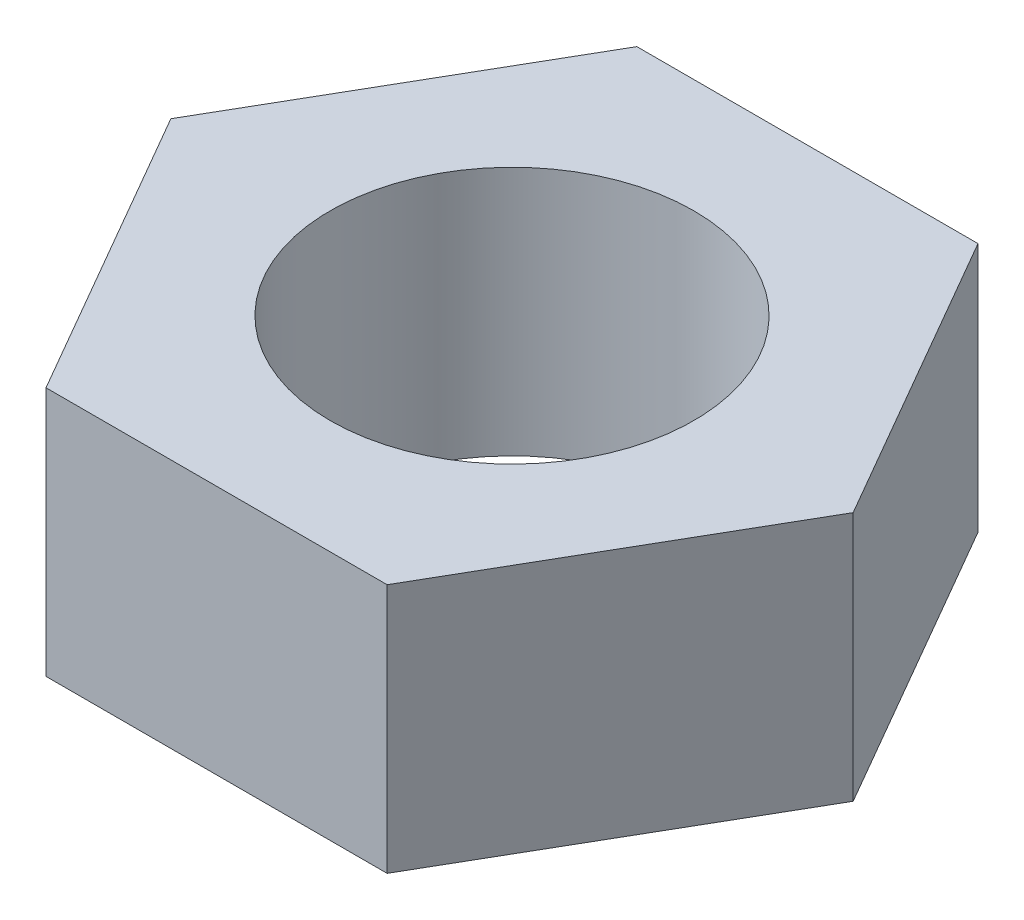
ISO-10303-21;
HEADER;
FILE_DESCRIPTION(('STEP AP214'),'2;1');
FILE_NAME('part.step','',(''),(''),'','','');
FILE_SCHEMA(('AUTOMOTIVE_DESIGN { 1 0 10303 214 1 1 1 1 }'));
ENDSEC;
DATA;
#1=APPLICATION_CONTEXT('core data for automotive mechanical design processes');
#2=APPLICATION_PROTOCOL_DEFINITION('international standard','automotive_design',2000,#1);
#3=PRODUCT_CONTEXT('',#1,'mechanical');
#4=PRODUCT('Part','Part','',(#3));
#5=PRODUCT_RELATED_PRODUCT_CATEGORY('part','',(#4));
#6=PRODUCT_DEFINITION_FORMATION('','',#4);
#7=PRODUCT_DEFINITION_CONTEXT('part definition',#1,'design');
#8=PRODUCT_DEFINITION('design','',#6,#7);
#9=PRODUCT_DEFINITION_SHAPE('','',#8);
#10=(LENGTH_UNIT() NAMED_UNIT(*) SI_UNIT(.MILLI.,.METRE.));
#11=(NAMED_UNIT(*) PLANE_ANGLE_UNIT() SI_UNIT($,.RADIAN.));
#12=(NAMED_UNIT(*) SI_UNIT($,.STERADIAN.) SOLID_ANGLE_UNIT());
#13=UNCERTAINTY_MEASURE_WITH_UNIT(LENGTH_MEASURE(1.E-05),#10,'distance_accuracy_value','');
#14=(GEOMETRIC_REPRESENTATION_CONTEXT(3) GLOBAL_UNCERTAINTY_ASSIGNED_CONTEXT((#13)) GLOBAL_UNIT_ASSIGNED_CONTEXT((#10,
#11,#12)) REPRESENTATION_CONTEXT('',''));
#15=CARTESIAN_POINT('',(0.,0.,0.));
#16=DIRECTION('',(0.,0.,1.));
#17=DIRECTION('',(1.,0.,0.));
#18=AXIS2_PLACEMENT_3D('',#15,#16,#17);
#19=CARTESIAN_POINT('',(0.,5.5,0.));
#20=DIRECTION('',(0.,1.,0.));
#21=DIRECTION('',(0.,0.,1.));
#22=AXIS2_PLACEMENT_3D('',#19,#20,#21);
#23=PLANE('',#22);
#24=DIRECTION('',(-1.,0.,0.));
#25=VECTOR('',#24,1.);
#26=CARTESIAN_POINT('',(3.75277674973257,5.5,-6.5));
#27=LINE('',#26,#25);
#28=CARTESIAN_POINT('',(3.75277674973257,5.5,-6.5));
#29=VERTEX_POINT('',#28);
#30=CARTESIAN_POINT('',(-3.75277674973257,5.5,-6.5));
#31=VERTEX_POINT('',#30);
#32=EDGE_CURVE('E128',#29,#31,#27,.T.);
#33=ORIENTED_EDGE('',*,*,#32,.T.);
#34=DIRECTION('',(-0.5,0.,0.866025403784439));
#35=VECTOR('',#34,1.);
#36=CARTESIAN_POINT('',(-3.75277674973257,5.5,-6.5));
#37=LINE('',#36,#35);
#38=CARTESIAN_POINT('',(-7.50555349946513,5.5,0.));
#39=VERTEX_POINT('',#38);
#40=EDGE_CURVE('E86',#31,#39,#37,.T.);
#41=ORIENTED_EDGE('',*,*,#40,.T.);
#42=DIRECTION('',(0.5,0.,0.866025403784439));
#43=VECTOR('',#42,1.);
#44=CARTESIAN_POINT('',(-7.50555349946513,5.5,0.));
#45=LINE('',#44,#43);
#46=CARTESIAN_POINT('',(-3.75277674973257,5.5,6.5));
#47=VERTEX_POINT('',#46);
#48=EDGE_CURVE('E99',#39,#47,#45,.T.);
#49=ORIENTED_EDGE('',*,*,#48,.T.);
#50=DIRECTION('',(1.,0.,0.));
#51=VECTOR('',#50,1.);
#52=CARTESIAN_POINT('',(-3.75277674973257,5.5,6.5));
#53=LINE('',#52,#51);
#54=CARTESIAN_POINT('',(3.75277674973257,5.5,6.5));
#55=VERTEX_POINT('',#54);
#56=EDGE_CURVE('E93',#47,#55,#53,.T.);
#57=ORIENTED_EDGE('',*,*,#56,.T.);
#58=DIRECTION('',(0.5,0.,-0.866025403784438));
#59=VECTOR('',#58,1.);
#60=CARTESIAN_POINT('',(3.75277674973257,5.5,6.5));
#61=LINE('',#60,#59);
#62=CARTESIAN_POINT('',(7.50555349946514,5.5,0.));
#63=VERTEX_POINT('',#62);
#64=EDGE_CURVE('E97',#55,#63,#61,.T.);
#65=ORIENTED_EDGE('',*,*,#64,.T.);
#66=DIRECTION('',(-0.5,0.,-0.866025403784439));
#67=VECTOR('',#66,1.);
#68=CARTESIAN_POINT('',(7.50555349946514,5.5,0.));
#69=LINE('',#68,#67);
#70=EDGE_CURVE('E49',#63,#29,#69,.T.);
#71=ORIENTED_EDGE('',*,*,#70,.T.);
#72=EDGE_LOOP('',(#33,#41,#49,#57,#65,#71));
#73=FACE_BOUND('',#72,.T.);
#74=CARTESIAN_POINT('',(0.,5.5,0.));
#75=DIRECTION('',(0.,1.,0.));
#76=DIRECTION('',(0.,0.,1.));
#77=AXIS2_PLACEMENT_3D('',#74,#75,#76);
#78=CIRCLE('',#77,4.);
#79=CARTESIAN_POINT('',(0.,5.5,4.));
#80=VERTEX_POINT('',#79);
#81=EDGE_CURVE('E121',#80,#80,#78,.T.);
#82=ORIENTED_EDGE('',*,*,#81,.F.);
#83=EDGE_LOOP('',(#82));
#84=FACE_BOUND('',#83,.T.);
#85=ADVANCED_FACE('F32',(#73,#84),#23,.T.);
#86=CARTESIAN_POINT('',(0.,0.,0.));
#87=DIRECTION('',(0.,1.,0.));
#88=DIRECTION('',(0.,0.,1.));
#89=AXIS2_PLACEMENT_3D('',#86,#87,#88);
#90=PLANE('',#89);
#91=DIRECTION('',(-1.,0.,0.));
#92=VECTOR('',#91,1.);
#93=CARTESIAN_POINT('',(3.75277674973257,0.,-6.5));
#94=LINE('',#93,#92);
#95=CARTESIAN_POINT('',(3.75277674973257,0.,-6.5));
#96=VERTEX_POINT('',#95);
#97=CARTESIAN_POINT('',(-3.75277674973257,0.,-6.5));
#98=VERTEX_POINT('',#97);
#99=EDGE_CURVE('E117',#96,#98,#94,.T.);
#100=ORIENTED_EDGE('',*,*,#99,.F.);
#101=DIRECTION('',(-0.5,0.,-0.866025403784439));
#102=VECTOR('',#101,1.);
#103=CARTESIAN_POINT('',(7.50555349946514,0.,0.));
#104=LINE('',#103,#102);
#105=CARTESIAN_POINT('',(7.50555349946514,0.,0.));
#106=VERTEX_POINT('',#105);
#107=EDGE_CURVE('E78',#106,#96,#104,.T.);
#108=ORIENTED_EDGE('',*,*,#107,.F.);
#109=DIRECTION('',(0.5,0.,-0.866025403784438));
#110=VECTOR('',#109,1.);
#111=CARTESIAN_POINT('',(3.75277674973257,0.,6.5));
#112=LINE('',#111,#110);
#113=CARTESIAN_POINT('',(3.75277674973257,0.,6.5));
#114=VERTEX_POINT('',#113);
#115=EDGE_CURVE('E72',#114,#106,#112,.T.);
#116=ORIENTED_EDGE('',*,*,#115,.F.);
#117=DIRECTION('',(1.,0.,0.));
#118=VECTOR('',#117,1.);
#119=CARTESIAN_POINT('',(-3.75277674973257,0.,6.5));
#120=LINE('',#119,#118);
#121=CARTESIAN_POINT('',(-3.75277674973257,0.,6.5));
#122=VERTEX_POINT('',#121);
#123=EDGE_CURVE('E107',#122,#114,#120,.T.);
#124=ORIENTED_EDGE('',*,*,#123,.F.);
#125=DIRECTION('',(0.5,0.,0.866025403784439));
#126=VECTOR('',#125,1.);
#127=CARTESIAN_POINT('',(-7.50555349946513,0.,0.));
#128=LINE('',#127,#126);
#129=CARTESIAN_POINT('',(-7.50555349946513,0.,0.));
#130=VERTEX_POINT('',#129);
#131=EDGE_CURVE('E123',#130,#122,#128,.T.);
#132=ORIENTED_EDGE('',*,*,#131,.F.);
#133=DIRECTION('',(-0.5,0.,0.866025403784439));
#134=VECTOR('',#133,1.);
#135=CARTESIAN_POINT('',(-3.75277674973257,0.,-6.5));
#136=LINE('',#135,#134);
#137=EDGE_CURVE('E120',#98,#130,#136,.T.);
#138=ORIENTED_EDGE('',*,*,#137,.F.);
#139=EDGE_LOOP('',(#100,#108,#116,#124,#132,#138));
#140=FACE_BOUND('',#139,.T.);
#141=CARTESIAN_POINT('',(0.,0.,0.));
#142=DIRECTION('',(0.,1.,0.));
#143=DIRECTION('',(0.,0.,1.));
#144=AXIS2_PLACEMENT_3D('',#141,#142,#143);
#145=CIRCLE('',#144,4.);
#146=CARTESIAN_POINT('',(0.,0.,4.));
#147=VERTEX_POINT('',#146);
#148=EDGE_CURVE('E221',#147,#147,#145,.T.);
#149=ORIENTED_EDGE('',*,*,#148,.T.);
#150=EDGE_LOOP('',(#149));
#151=FACE_BOUND('',#150,.T.);
#152=ADVANCED_FACE('F137',(#140,#151),#90,.F.);
#153=CARTESIAN_POINT('',(3.75277674973257,5.5,-6.5));
#154=DIRECTION('',(0.,0.,1.));
#155=DIRECTION('',(1.,0.,0.));
#156=AXIS2_PLACEMENT_3D('',#153,#154,#155);
#157=PLANE('',#156);
#158=ORIENTED_EDGE('',*,*,#99,.T.);
#159=DIRECTION('',(0.,-1.,0.));
#160=VECTOR('',#159,1.);
#161=CARTESIAN_POINT('',(-3.75277674973257,5.5,-6.5));
#162=LINE('',#161,#160);
#163=EDGE_CURVE('E11',#31,#98,#162,.T.);
#164=ORIENTED_EDGE('',*,*,#163,.F.);
#165=ORIENTED_EDGE('',*,*,#32,.F.);
#166=DIRECTION('',(0.,-1.,0.));
#167=VECTOR('',#166,1.);
#168=CARTESIAN_POINT('',(3.75277674973257,5.5,-6.5));
#169=LINE('',#168,#167);
#170=EDGE_CURVE('E113',#29,#96,#169,.T.);
#171=ORIENTED_EDGE('',*,*,#170,.T.);
#172=EDGE_LOOP('',(#158,#164,#165,#171));
#173=FACE_BOUND('',#172,.T.);
#174=ADVANCED_FACE('F34',(#173),#157,.F.);
#175=CARTESIAN_POINT('',(-3.75277674973257,5.5,-6.5));
#176=DIRECTION('',(0.866025403784439,0.,0.5));
#177=DIRECTION('',(0.5,0.,-0.866025403784439));
#178=AXIS2_PLACEMENT_3D('',#175,#176,#177);
#179=PLANE('',#178);
#180=ORIENTED_EDGE('',*,*,#137,.T.);
#181=DIRECTION('',(0.,-1.,0.));
#182=VECTOR('',#181,1.);
#183=CARTESIAN_POINT('',(-7.50555349946513,5.5,0.));
#184=LINE('',#183,#182);
#185=EDGE_CURVE('E41',#39,#130,#184,.T.);
#186=ORIENTED_EDGE('',*,*,#185,.F.);
#187=ORIENTED_EDGE('',*,*,#40,.F.);
#188=ORIENTED_EDGE('',*,*,#163,.T.);
#189=EDGE_LOOP('',(#180,#186,#187,#188));
#190=FACE_BOUND('',#189,.T.);
#191=ADVANCED_FACE('F162',(#190),#179,.F.);
#192=CARTESIAN_POINT('',(-7.50555349946513,5.5,0.));
#193=DIRECTION('',(0.866025403784439,0.,-0.5));
#194=DIRECTION('',(-0.5,0.,-0.866025403784439));
#195=AXIS2_PLACEMENT_3D('',#192,#193,#194);
#196=PLANE('',#195);
#197=ORIENTED_EDGE('',*,*,#131,.T.);
#198=DIRECTION('',(0.,-1.,0.));
#199=VECTOR('',#198,1.);
#200=CARTESIAN_POINT('',(-3.75277674973257,5.5,6.5));
#201=LINE('',#200,#199);
#202=EDGE_CURVE('E108',#47,#122,#201,.T.);
#203=ORIENTED_EDGE('',*,*,#202,.F.);
#204=ORIENTED_EDGE('',*,*,#48,.F.);
#205=ORIENTED_EDGE('',*,*,#185,.T.);
#206=EDGE_LOOP('',(#197,#203,#204,#205));
#207=FACE_BOUND('',#206,.T.);
#208=ADVANCED_FACE('F134',(#207),#196,.F.);
#209=CARTESIAN_POINT('',(-3.75277674973257,5.5,6.5));
#210=DIRECTION('',(0.,0.,-1.));
#211=DIRECTION('',(-1.,0.,0.));
#212=AXIS2_PLACEMENT_3D('',#209,#210,#211);
#213=PLANE('',#212);
#214=ORIENTED_EDGE('',*,*,#123,.T.);
#215=DIRECTION('',(0.,-1.,0.));
#216=VECTOR('',#215,1.);
#217=CARTESIAN_POINT('',(3.75277674973257,5.5,6.5));
#218=LINE('',#217,#216);
#219=EDGE_CURVE('E104',#55,#114,#218,.T.);
#220=ORIENTED_EDGE('',*,*,#219,.F.);
#221=ORIENTED_EDGE('',*,*,#56,.F.);
#222=ORIENTED_EDGE('',*,*,#202,.T.);
#223=EDGE_LOOP('',(#214,#220,#221,#222));
#224=FACE_BOUND('',#223,.T.);
#225=ADVANCED_FACE('F105',(#224),#213,.F.);
#226=CARTESIAN_POINT('',(3.75277674973257,5.5,6.5));
#227=DIRECTION('',(-0.866025403784438,0.,-0.500000000000001));
#228=DIRECTION('',(-0.500000000000001,0.,0.866025403784438));
#229=AXIS2_PLACEMENT_3D('',#226,#227,#228);
#230=PLANE('',#229);
#231=ORIENTED_EDGE('',*,*,#115,.T.);
#232=DIRECTION('',(0.,-1.,0.));
#233=VECTOR('',#232,1.);
#234=CARTESIAN_POINT('',(7.50555349946514,5.5,0.));
#235=LINE('',#234,#233);
#236=EDGE_CURVE('E109',#63,#106,#235,.T.);
#237=ORIENTED_EDGE('',*,*,#236,.F.);
#238=ORIENTED_EDGE('',*,*,#64,.F.);
#239=ORIENTED_EDGE('',*,*,#219,.T.);
#240=EDGE_LOOP('',(#231,#237,#238,#239));
#241=FACE_BOUND('',#240,.T.);
#242=ADVANCED_FACE('F111',(#241),#230,.F.);
#243=CARTESIAN_POINT('',(7.50555349946514,5.5,0.));
#244=DIRECTION('',(-0.866025403784439,0.,0.5));
#245=DIRECTION('',(0.5,0.,0.866025403784439));
#246=AXIS2_PLACEMENT_3D('',#243,#244,#245);
#247=PLANE('',#246);
#248=ORIENTED_EDGE('',*,*,#107,.T.);
#249=ORIENTED_EDGE('',*,*,#170,.F.);
#250=ORIENTED_EDGE('',*,*,#70,.F.);
#251=ORIENTED_EDGE('',*,*,#236,.T.);
#252=EDGE_LOOP('',(#248,#249,#250,#251));
#253=FACE_BOUND('',#252,.T.);
#254=ADVANCED_FACE('F142',(#253),#247,.F.);
#255=CARTESIAN_POINT('',(0.,5.5,0.));
#256=DIRECTION('',(0.,-1.,0.));
#257=DIRECTION('',(0.,0.,-1.));
#258=AXIS2_PLACEMENT_3D('',#255,#256,#257);
#259=CYLINDRICAL_SURFACE('',#258,4.);
#260=ORIENTED_EDGE('',*,*,#81,.T.);
#261=EDGE_LOOP('',(#260));
#262=FACE_BOUND('',#261,.T.);
#263=ORIENTED_EDGE('',*,*,#148,.F.);
#264=EDGE_LOOP('',(#263));
#265=FACE_BOUND('',#264,.T.);
#266=ADVANCED_FACE('F144',(#262,#265),#259,.F.);
#267=CLOSED_SHELL('',(#85,#152,#174,#191,#208,#225,#242,#254,#266));
#268=MANIFOLD_SOLID_BREP('B2',#267);
#269=ADVANCED_BREP_SHAPE_REPRESENTATION('',(#18,#268),#14);
#270=SHAPE_DEFINITION_REPRESENTATION(#9,#269);
ENDSEC;
END-ISO-10303-21;
